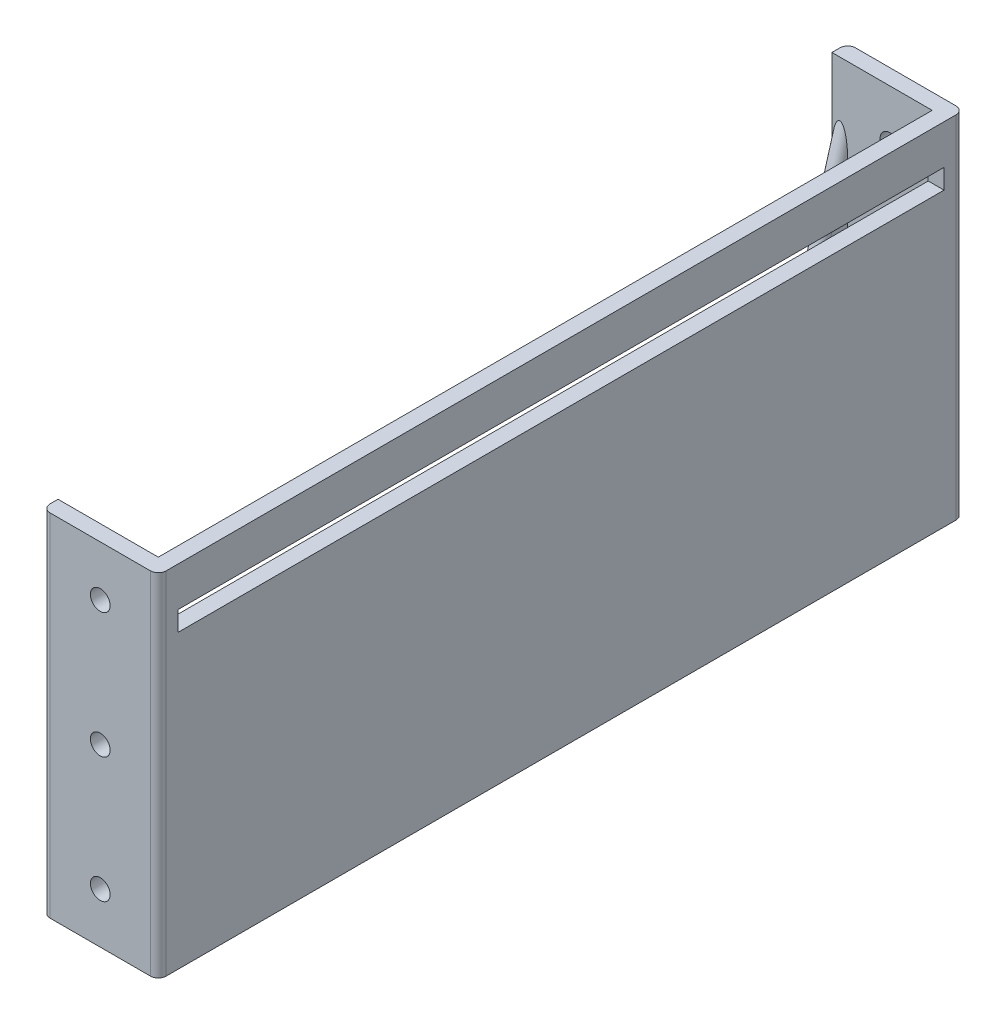
ISO-10303-21;
HEADER;
FILE_DESCRIPTION(('STEP AP214'),'2;1');
FILE_NAME('part.step','',(''),(''),'','','');
FILE_SCHEMA(('AUTOMOTIVE_DESIGN { 1 0 10303 214 1 1 1 1 }'));
ENDSEC;
DATA;
#1=APPLICATION_CONTEXT('core data for automotive mechanical design processes');
#2=APPLICATION_PROTOCOL_DEFINITION('international standard','automotive_design',2000,#1);
#3=PRODUCT_CONTEXT('',#1,'mechanical');
#4=PRODUCT('Part','Part','',(#3));
#5=PRODUCT_RELATED_PRODUCT_CATEGORY('part','',(#4));
#6=PRODUCT_DEFINITION_FORMATION('','',#4);
#7=PRODUCT_DEFINITION_CONTEXT('part definition',#1,'design');
#8=PRODUCT_DEFINITION('design','',#6,#7);
#9=PRODUCT_DEFINITION_SHAPE('','',#8);
#10=(LENGTH_UNIT() NAMED_UNIT(*) SI_UNIT(.MILLI.,.METRE.));
#11=(NAMED_UNIT(*) PLANE_ANGLE_UNIT() SI_UNIT($,.RADIAN.));
#12=(NAMED_UNIT(*) SI_UNIT($,.STERADIAN.) SOLID_ANGLE_UNIT());
#13=UNCERTAINTY_MEASURE_WITH_UNIT(LENGTH_MEASURE(1.E-05),#10,'distance_accuracy_value','');
#14=(GEOMETRIC_REPRESENTATION_CONTEXT(3) GLOBAL_UNCERTAINTY_ASSIGNED_CONTEXT((#13)) GLOBAL_UNIT_ASSIGNED_CONTEXT((#10,
#11,#12)) REPRESENTATION_CONTEXT('',''));
#15=CARTESIAN_POINT('',(0.,0.,0.));
#16=DIRECTION('',(0.,0.,1.));
#17=DIRECTION('',(1.,0.,0.));
#18=AXIS2_PLACEMENT_3D('',#15,#16,#17);
#19=CARTESIAN_POINT('',(2.,81.6198901107195,4.));
#20=DIRECTION('',(0.,-0.961523947640823,-0.274721127897378));
#21=DIRECTION('',(0.,0.274721127897378,-0.961523947640823));
#22=AXIS2_PLACEMENT_3D('',#19,#20,#21);
#23=CYLINDRICAL_SURFACE('',#22,2.);
#24=DIRECTION('',(0.,0.961523947640823,0.274721127897378));
#25=VECTOR('',#24,1.);
#26=CARTESIAN_POINT('',(0.,81.6198901107195,4.));
#27=LINE('',#26,#25);
#28=CARTESIAN_POINT('',(0.,67.6198901107195,0.));
#29=VERTEX_POINT('',#28);
#30=CARTESIAN_POINT('',(0.,4.,-18.1771114602056));
#31=VERTEX_POINT('',#30);
#32=EDGE_CURVE('E319',#29,#31,#27,.F.);
#33=ORIENTED_EDGE('',*,*,#32,.F.);
#34=CARTESIAN_POINT('',(2.,67.6198901107195,0.));
#35=DIRECTION('',(0.,0.,-1.));
#36=DIRECTION('',(0.,-1.,0.));
#37=AXIS2_PLACEMENT_3D('',#34,#35,#36);
#38=ELLIPSE('',#37,7.28010988928051,2.);
#39=CARTESIAN_POINT('',(4.,67.6198901107195,0.));
#40=VERTEX_POINT('',#39);
#41=EDGE_CURVE('E325',#40,#29,#38,.F.);
#42=ORIENTED_EDGE('',*,*,#41,.F.);
#43=DIRECTION('',(0.,-0.961523947640823,-0.274721127897378));
#44=VECTOR('',#43,1.);
#45=CARTESIAN_POINT('',(4.,5.10338793288449,-17.8618577650957));
#46=LINE('',#45,#44);
#47=CARTESIAN_POINT('',(4.,4.,-18.1771114602056));
#48=VERTEX_POINT('',#47);
#49=EDGE_CURVE('E322',#48,#40,#46,.F.);
#50=ORIENTED_EDGE('',*,*,#49,.F.);
#51=CARTESIAN_POINT('',(2.,4.,-18.1771114602056));
#52=DIRECTION('',(0.,-1.,0.));
#53=DIRECTION('',(0.,0.,-1.));
#54=AXIS2_PLACEMENT_3D('',#51,#52,#53);
#55=ELLIPSE('',#54,2.08003139693729,2.);
#56=EDGE_CURVE('E328',#31,#48,#55,.T.);
#57=ORIENTED_EDGE('',*,*,#56,.F.);
#58=EDGE_LOOP('',(#33,#42,#50,#57));
#59=FACE_BOUND('',#58,.T.);
#60=ADVANCED_FACE('F35',(#59),#23,.T.);
#61=CARTESIAN_POINT('',(2.,0.,-176.680031396937));
#62=DIRECTION('',(0.,0.961523947640823,-0.274721127897378));
#63=DIRECTION('',(0.,0.274721127897378,0.961523947640823));
#64=AXIS2_PLACEMENT_3D('',#61,#62,#63);
#65=CYLINDRICAL_SURFACE('',#64,2.00000000000001);
#66=DIRECTION('',(0.,-0.961523947640823,0.274721127897378));
#67=VECTOR('',#66,1.);
#68=CARTESIAN_POINT('',(0.,0.,-176.680031396937));
#69=LINE('',#68,#67);
#70=CARTESIAN_POINT('',(0.,4.,-177.822888539794));
#71=VERTEX_POINT('',#70);
#72=CARTESIAN_POINT('',(0.,67.6198901107195,-196.));
#73=VERTEX_POINT('',#72);
#74=EDGE_CURVE('E308',#71,#73,#69,.F.);
#75=ORIENTED_EDGE('',*,*,#74,.F.);
#76=CARTESIAN_POINT('',(2.,4.,-177.822888539794));
#77=DIRECTION('',(0.,-1.,0.));
#78=DIRECTION('',(0.,0.,-1.));
#79=AXIS2_PLACEMENT_3D('',#76,#77,#78);
#80=ELLIPSE('',#79,2.0800313969373,2.00000000000001);
#81=CARTESIAN_POINT('',(4.,4.,-177.822888539794));
#82=VERTEX_POINT('',#81);
#83=EDGE_CURVE('E314',#82,#71,#80,.T.);
#84=ORIENTED_EDGE('',*,*,#83,.F.);
#85=DIRECTION('',(0.,0.961523947640823,-0.274721127897378));
#86=VECTOR('',#85,1.);
#87=CARTESIAN_POINT('',(4.,-46.6701969727759,-163.345689404716));
#88=LINE('',#87,#86);
#89=CARTESIAN_POINT('',(4.,67.6198901107195,-196.));
#90=VERTEX_POINT('',#89);
#91=EDGE_CURVE('E311',#90,#82,#88,.F.);
#92=ORIENTED_EDGE('',*,*,#91,.F.);
#93=CARTESIAN_POINT('',(2.,67.6198901107195,-196.));
#94=DIRECTION('',(0.,0.,1.));
#95=DIRECTION('',(0.,1.,0.));
#96=AXIS2_PLACEMENT_3D('',#93,#94,#95);
#97=ELLIPSE('',#96,7.28010988928054,2.00000000000001);
#98=EDGE_CURVE('E317',#73,#90,#97,.F.);
#99=ORIENTED_EDGE('',*,*,#98,.F.);
#100=EDGE_LOOP('',(#75,#84,#92,#99));
#101=FACE_BOUND('',#100,.T.);
#102=ADVANCED_FACE('F431',(#101),#65,.T.);
#103=CARTESIAN_POINT('',(0.,0.,0.));
#104=DIRECTION('',(0.,0.,-1.));
#105=DIRECTION('',(-1.,0.,0.));
#106=AXIS2_PLACEMENT_3D('',#103,#104,#105);
#107=PLANE('',#106);
#108=CARTESIAN_POINT('',(14.7,12.75,0.));
#109=DIRECTION('',(0.,0.,-1.));
#110=DIRECTION('',(-1.,0.,0.));
#111=AXIS2_PLACEMENT_3D('',#108,#109,#110);
#112=CIRCLE('',#111,2.5);
#113=CARTESIAN_POINT('',(12.2,12.75,0.));
#114=VERTEX_POINT('',#113);
#115=EDGE_CURVE('E241',#114,#114,#112,.T.);
#116=ORIENTED_EDGE('',*,*,#115,.F.);
#117=EDGE_LOOP('',(#116));
#118=FACE_BOUND('',#117,.T.);
#119=CARTESIAN_POINT('',(14.7,76.15,0.));
#120=DIRECTION('',(0.,0.,-1.));
#121=DIRECTION('',(-1.,0.,0.));
#122=AXIS2_PLACEMENT_3D('',#119,#120,#121);
#123=CIRCLE('',#122,2.5);
#124=CARTESIAN_POINT('',(12.2,76.15,0.));
#125=VERTEX_POINT('',#124);
#126=EDGE_CURVE('E235',#125,#125,#123,.T.);
#127=ORIENTED_EDGE('',*,*,#126,.F.);
#128=EDGE_LOOP('',(#127));
#129=FACE_BOUND('',#128,.T.);
#130=CARTESIAN_POINT('',(14.7,44.45,0.));
#131=DIRECTION('',(0.,0.,-1.));
#132=DIRECTION('',(-1.,0.,0.));
#133=AXIS2_PLACEMENT_3D('',#130,#131,#132);
#134=CIRCLE('',#133,2.5);
#135=CARTESIAN_POINT('',(12.2,44.45,0.));
#136=VERTEX_POINT('',#135);
#137=EDGE_CURVE('E229',#136,#136,#134,.T.);
#138=ORIENTED_EDGE('',*,*,#137,.F.);
#139=EDGE_LOOP('',(#138));
#140=FACE_BOUND('',#139,.T.);
#141=ORIENTED_EDGE('',*,*,#41,.T.);
#142=DIRECTION('',(0.,-1.,0.));
#143=VECTOR('',#142,1.);
#144=CARTESIAN_POINT('',(0.,0.,0.));
#145=LINE('',#144,#143);
#146=CARTESIAN_POINT('',(0.,88.9,0.));
#147=VERTEX_POINT('',#146);
#148=EDGE_CURVE('E280',#147,#29,#145,.T.);
#149=ORIENTED_EDGE('',*,*,#148,.F.);
#150=DIRECTION('',(-1.,0.,0.));
#151=VECTOR('',#150,1.);
#152=CARTESIAN_POINT('',(0.,88.9,0.));
#153=LINE('',#152,#151);
#154=CARTESIAN_POINT('',(25.4,88.9,0.));
#155=VERTEX_POINT('',#154);
#156=EDGE_CURVE('E288',#155,#147,#153,.T.);
#157=ORIENTED_EDGE('',*,*,#156,.F.);
#158=DIRECTION('',(0.,1.,0.));
#159=VECTOR('',#158,1.);
#160=CARTESIAN_POINT('',(25.4,0.,0.));
#161=LINE('',#160,#159);
#162=CARTESIAN_POINT('',(25.4,4.,0.));
#163=VERTEX_POINT('',#162);
#164=EDGE_CURVE('E293',#163,#155,#161,.T.);
#165=ORIENTED_EDGE('',*,*,#164,.F.);
#166=DIRECTION('',(-1.,0.,0.));
#167=VECTOR('',#166,1.);
#168=CARTESIAN_POINT('',(0.,4.,0.));
#169=LINE('',#168,#167);
#170=CARTESIAN_POINT('',(4.,4.,0.));
#171=VERTEX_POINT('',#170);
#172=EDGE_CURVE('E255',#163,#171,#169,.T.);
#173=ORIENTED_EDGE('',*,*,#172,.T.);
#174=DIRECTION('',(0.,-1.,0.));
#175=VECTOR('',#174,1.);
#176=CARTESIAN_POINT('',(4.,0.,0.));
#177=LINE('',#176,#175);
#178=EDGE_CURVE('E244',#40,#171,#177,.T.);
#179=ORIENTED_EDGE('',*,*,#178,.F.);
#180=EDGE_LOOP('',(#141,#149,#157,#165,#173,#179));
#181=FACE_BOUND('',#180,.T.);
#182=ADVANCED_FACE('F399',(#118,#129,#140,#181),#107,.T.);
#183=CARTESIAN_POINT('',(25.4,0.,0.));
#184=DIRECTION('',(-1.,0.,0.));
#185=DIRECTION('',(0.,0.,1.));
#186=AXIS2_PLACEMENT_3D('',#183,#184,#185);
#187=PLANE('',#186);
#188=DIRECTION('',(0.,-1.,0.));
#189=VECTOR('',#188,1.);
#190=CARTESIAN_POINT('',(25.4,78.9,-1.));
#191=LINE('',#190,#189);
#192=CARTESIAN_POINT('',(25.4,78.9,-1.));
#193=VERTEX_POINT('',#192);
#194=CARTESIAN_POINT('',(25.4,73.9,-1.));
#195=VERTEX_POINT('',#194);
#196=EDGE_CURVE('E174',#193,#195,#191,.T.);
#197=ORIENTED_EDGE('',*,*,#196,.T.);
#198=DIRECTION('',(0.,0.,-1.));
#199=VECTOR('',#198,1.);
#200=CARTESIAN_POINT('',(25.4,73.9,-1.));
#201=LINE('',#200,#199);
#202=CARTESIAN_POINT('',(25.4,73.9,-195.));
#203=VERTEX_POINT('',#202);
#204=EDGE_CURVE('E183',#195,#203,#201,.T.);
#205=ORIENTED_EDGE('',*,*,#204,.T.);
#206=DIRECTION('',(0.,1.,0.));
#207=VECTOR('',#206,1.);
#208=CARTESIAN_POINT('',(25.4,78.9,-195.));
#209=LINE('',#208,#207);
#210=CARTESIAN_POINT('',(25.4,78.9,-195.));
#211=VERTEX_POINT('',#210);
#212=EDGE_CURVE('E50',#203,#211,#209,.T.);
#213=ORIENTED_EDGE('',*,*,#212,.T.);
#214=DIRECTION('',(0.,0.,1.));
#215=VECTOR('',#214,1.);
#216=CARTESIAN_POINT('',(25.4,78.9,-1.));
#217=LINE('',#216,#215);
#218=EDGE_CURVE('E180',#211,#193,#217,.T.);
#219=ORIENTED_EDGE('',*,*,#218,.T.);
#220=EDGE_LOOP('',(#197,#205,#213,#219));
#221=FACE_BOUND('',#220,.T.);
#222=DIRECTION('',(0.,1.,0.));
#223=VECTOR('',#222,1.);
#224=CARTESIAN_POINT('',(25.4,0.,-196.));
#225=LINE('',#224,#223);
#226=CARTESIAN_POINT('',(25.4,4.,-196.));
#227=VERTEX_POINT('',#226);
#228=CARTESIAN_POINT('',(25.4,88.9,-196.));
#229=VERTEX_POINT('',#228);
#230=EDGE_CURVE('E272',#227,#229,#225,.T.);
#231=ORIENTED_EDGE('',*,*,#230,.F.);
#232=DIRECTION('',(0.,0.,1.));
#233=VECTOR('',#232,1.);
#234=CARTESIAN_POINT('',(25.4,4.,0.));
#235=LINE('',#234,#233);
#236=EDGE_CURVE('E252',#227,#163,#235,.T.);
#237=ORIENTED_EDGE('',*,*,#236,.T.);
#238=ORIENTED_EDGE('',*,*,#164,.T.);
#239=DIRECTION('',(0.,0.,1.));
#240=VECTOR('',#239,1.);
#241=CARTESIAN_POINT('',(25.4,88.9,4.));
#242=LINE('',#241,#240);
#243=EDGE_CURVE('E277',#229,#155,#242,.T.);
#244=ORIENTED_EDGE('',*,*,#243,.F.);
#245=EDGE_LOOP('',(#231,#237,#238,#244));
#246=FACE_BOUND('',#245,.T.);
#247=ADVANCED_FACE('F187',(#221,#246),#187,.T.);
#248=CARTESIAN_POINT('',(0.,0.,-196.));
#249=DIRECTION('',(0.,0.,1.));
#250=DIRECTION('',(1.,0.,0.));
#251=AXIS2_PLACEMENT_3D('',#248,#249,#250);
#252=PLANE('',#251);
#253=CARTESIAN_POINT('',(14.7,12.75,-196.));
#254=DIRECTION('',(0.,0.,1.));
#255=DIRECTION('',(1.,0.,0.));
#256=AXIS2_PLACEMENT_3D('',#253,#254,#255);
#257=CIRCLE('',#256,2.5);
#258=CARTESIAN_POINT('',(17.2,12.75,-196.));
#259=VERTEX_POINT('',#258);
#260=EDGE_CURVE('E238',#259,#259,#257,.T.);
#261=ORIENTED_EDGE('',*,*,#260,.F.);
#262=EDGE_LOOP('',(#261));
#263=FACE_BOUND('',#262,.T.);
#264=CARTESIAN_POINT('',(14.7,76.15,-196.));
#265=DIRECTION('',(0.,0.,1.));
#266=DIRECTION('',(1.,0.,0.));
#267=AXIS2_PLACEMENT_3D('',#264,#265,#266);
#268=CIRCLE('',#267,2.5);
#269=CARTESIAN_POINT('',(17.2,76.15,-196.));
#270=VERTEX_POINT('',#269);
#271=EDGE_CURVE('E232',#270,#270,#268,.T.);
#272=ORIENTED_EDGE('',*,*,#271,.F.);
#273=EDGE_LOOP('',(#272));
#274=FACE_BOUND('',#273,.T.);
#275=CARTESIAN_POINT('',(14.7,44.45,-196.));
#276=DIRECTION('',(0.,0.,1.));
#277=DIRECTION('',(1.,0.,0.));
#278=AXIS2_PLACEMENT_3D('',#275,#276,#277);
#279=CIRCLE('',#278,2.5);
#280=CARTESIAN_POINT('',(17.2,44.45,-196.));
#281=VERTEX_POINT('',#280);
#282=EDGE_CURVE('E212',#281,#281,#279,.T.);
#283=ORIENTED_EDGE('',*,*,#282,.F.);
#284=EDGE_LOOP('',(#283));
#285=FACE_BOUND('',#284,.T.);
#286=DIRECTION('',(0.,1.,0.));
#287=VECTOR('',#286,1.);
#288=CARTESIAN_POINT('',(0.,0.,-196.));
#289=LINE('',#288,#287);
#290=CARTESIAN_POINT('',(0.,88.9,-196.));
#291=VERTEX_POINT('',#290);
#292=EDGE_CURVE('E258',#73,#291,#289,.T.);
#293=ORIENTED_EDGE('',*,*,#292,.F.);
#294=ORIENTED_EDGE('',*,*,#98,.T.);
#295=DIRECTION('',(0.,1.,0.));
#296=VECTOR('',#295,1.);
#297=CARTESIAN_POINT('',(4.,0.,-196.));
#298=LINE('',#297,#296);
#299=CARTESIAN_POINT('',(4.,4.,-196.));
#300=VERTEX_POINT('',#299);
#301=EDGE_CURVE('E247',#300,#90,#298,.T.);
#302=ORIENTED_EDGE('',*,*,#301,.F.);
#303=DIRECTION('',(1.,0.,0.));
#304=VECTOR('',#303,1.);
#305=CARTESIAN_POINT('',(0.,4.,-196.));
#306=LINE('',#305,#304);
#307=EDGE_CURVE('E301',#300,#227,#306,.T.);
#308=ORIENTED_EDGE('',*,*,#307,.T.);
#309=ORIENTED_EDGE('',*,*,#230,.T.);
#310=DIRECTION('',(1.,0.,0.));
#311=VECTOR('',#310,1.);
#312=CARTESIAN_POINT('',(29.4,88.9,-196.));
#313=LINE('',#312,#311);
#314=EDGE_CURVE('E263',#291,#229,#313,.T.);
#315=ORIENTED_EDGE('',*,*,#314,.F.);
#316=EDGE_LOOP('',(#293,#294,#302,#308,#309,#315));
#317=FACE_BOUND('',#316,.T.);
#318=ADVANCED_FACE('F389',(#263,#274,#285,#317),#252,.T.);
#319=CARTESIAN_POINT('',(0.,0.,4.));
#320=DIRECTION('',(1.,0.,0.));
#321=DIRECTION('',(0.,0.,-1.));
#322=AXIS2_PLACEMENT_3D('',#319,#320,#321);
#323=PLANE('',#322);
#324=DIRECTION('',(0.,0.,-1.));
#325=VECTOR('',#324,1.);
#326=CARTESIAN_POINT('',(0.,0.,4.));
#327=LINE('',#326,#325);
#328=CARTESIAN_POINT('',(0.,0.,2.));
#329=VERTEX_POINT('',#328);
#330=CARTESIAN_POINT('',(0.,0.,-198.));
#331=VERTEX_POINT('',#330);
#332=EDGE_CURVE('E298',#329,#331,#327,.T.);
#333=ORIENTED_EDGE('',*,*,#332,.F.);
#334=DIRECTION('',(0.,-1.,0.));
#335=VECTOR('',#334,1.);
#336=CARTESIAN_POINT('',(0.,0.,2.));
#337=LINE('',#336,#335);
#338=CARTESIAN_POINT('',(0.,88.9,2.));
#339=VERTEX_POINT('',#338);
#340=EDGE_CURVE('E345',#329,#339,#337,.F.);
#341=ORIENTED_EDGE('',*,*,#340,.T.);
#342=DIRECTION('',(0.,0.,-1.));
#343=VECTOR('',#342,1.);
#344=CARTESIAN_POINT('',(0.,88.9,4.));
#345=LINE('',#344,#343);
#346=EDGE_CURVE('E291',#339,#147,#345,.T.);
#347=ORIENTED_EDGE('',*,*,#346,.T.);
#348=ORIENTED_EDGE('',*,*,#148,.T.);
#349=ORIENTED_EDGE('',*,*,#32,.T.);
#350=DIRECTION('',(0.,0.,-1.));
#351=VECTOR('',#350,1.);
#352=CARTESIAN_POINT('',(0.,4.,-200.));
#353=LINE('',#352,#351);
#354=EDGE_CURVE('E250',#31,#71,#353,.T.);
#355=ORIENTED_EDGE('',*,*,#354,.T.);
#356=ORIENTED_EDGE('',*,*,#74,.T.);
#357=ORIENTED_EDGE('',*,*,#292,.T.);
#358=DIRECTION('',(0.,0.,1.));
#359=VECTOR('',#358,1.);
#360=CARTESIAN_POINT('',(0.,88.9,-200.));
#361=LINE('',#360,#359);
#362=CARTESIAN_POINT('',(0.,88.9,-198.));
#363=VERTEX_POINT('',#362);
#364=EDGE_CURVE('E266',#363,#291,#361,.T.);
#365=ORIENTED_EDGE('',*,*,#364,.F.);
#366=DIRECTION('',(0.,1.,0.));
#367=VECTOR('',#366,1.);
#368=CARTESIAN_POINT('',(0.,0.,-198.));
#369=LINE('',#368,#367);
#370=EDGE_CURVE('E343',#363,#331,#369,.F.);
#371=ORIENTED_EDGE('',*,*,#370,.T.);
#372=EDGE_LOOP('',(#333,#341,#347,#348,#349,#355,#356,#357,#365,#371));
#373=FACE_BOUND('',#372,.T.);
#374=ADVANCED_FACE('F384',(#373),#323,.F.);
#375=CARTESIAN_POINT('',(0.,0.,4.));
#376=DIRECTION('',(0.,1.,0.));
#377=DIRECTION('',(0.,0.,1.));
#378=AXIS2_PLACEMENT_3D('',#375,#376,#377);
#379=PLANE('',#378);
#380=DIRECTION('',(1.,0.,0.));
#381=VECTOR('',#380,1.);
#382=CARTESIAN_POINT('',(0.,0.,4.));
#383=LINE('',#382,#381);
#384=CARTESIAN_POINT('',(2.,0.,4.));
#385=VERTEX_POINT('',#384);
#386=CARTESIAN_POINT('',(27.4,0.,4.));
#387=VERTEX_POINT('',#386);
#388=EDGE_CURVE('E284',#385,#387,#383,.T.);
#389=ORIENTED_EDGE('',*,*,#388,.F.);
#390=CARTESIAN_POINT('',(2.,0.,2.));
#391=DIRECTION('',(0.,1.,0.));
#392=DIRECTION('',(0.,0.,1.));
#393=AXIS2_PLACEMENT_3D('',#390,#391,#392);
#394=CIRCLE('',#393,2.);
#395=EDGE_CURVE('E341',#385,#329,#394,.F.);
#396=ORIENTED_EDGE('',*,*,#395,.T.);
#397=ORIENTED_EDGE('',*,*,#332,.T.);
#398=CARTESIAN_POINT('',(2.,0.,-198.));
#399=DIRECTION('',(0.,1.,0.));
#400=DIRECTION('',(0.,0.,1.));
#401=AXIS2_PLACEMENT_3D('',#398,#399,#400);
#402=CIRCLE('',#401,2.);
#403=CARTESIAN_POINT('',(2.,0.,-200.));
#404=VERTEX_POINT('',#403);
#405=EDGE_CURVE('E335',#331,#404,#402,.F.);
#406=ORIENTED_EDGE('',*,*,#405,.T.);
#407=DIRECTION('',(-1.,0.,0.));
#408=VECTOR('',#407,1.);
#409=CARTESIAN_POINT('',(29.4,0.,-200.));
#410=LINE('',#409,#408);
#411=CARTESIAN_POINT('',(27.4,0.,-200.));
#412=VERTEX_POINT('',#411);
#413=EDGE_CURVE('E259',#412,#404,#410,.T.);
#414=ORIENTED_EDGE('',*,*,#413,.F.);
#415=CARTESIAN_POINT('',(27.4,0.,-198.));
#416=DIRECTION('',(0.,1.,0.));
#417=DIRECTION('',(0.,0.,1.));
#418=AXIS2_PLACEMENT_3D('',#415,#416,#417);
#419=CIRCLE('',#418,2.);
#420=CARTESIAN_POINT('',(29.4,0.,-198.));
#421=VERTEX_POINT('',#420);
#422=EDGE_CURVE('E337',#412,#421,#419,.F.);
#423=ORIENTED_EDGE('',*,*,#422,.T.);
#424=DIRECTION('',(0.,0.,-1.));
#425=VECTOR('',#424,1.);
#426=CARTESIAN_POINT('',(29.4,0.,4.));
#427=LINE('',#426,#425);
#428=CARTESIAN_POINT('',(29.4,0.,2.));
#429=VERTEX_POINT('',#428);
#430=EDGE_CURVE('E273',#429,#421,#427,.T.);
#431=ORIENTED_EDGE('',*,*,#430,.F.);
#432=CARTESIAN_POINT('',(27.4,0.,2.));
#433=DIRECTION('',(0.,1.,0.));
#434=DIRECTION('',(0.,0.,1.));
#435=AXIS2_PLACEMENT_3D('',#432,#433,#434);
#436=CIRCLE('',#435,2.);
#437=EDGE_CURVE('E339',#429,#387,#436,.F.);
#438=ORIENTED_EDGE('',*,*,#437,.T.);
#439=EDGE_LOOP('',(#389,#396,#397,#406,#414,#423,#431,#438));
#440=FACE_BOUND('',#439,.T.);
#441=ADVANCED_FACE('F379',(#440),#379,.F.);
#442=CARTESIAN_POINT('',(0.,88.9,4.));
#443=DIRECTION('',(0.,-1.,0.));
#444=DIRECTION('',(0.,0.,-1.));
#445=AXIS2_PLACEMENT_3D('',#442,#443,#444);
#446=PLANE('',#445);
#447=ORIENTED_EDGE('',*,*,#346,.F.);
#448=CARTESIAN_POINT('',(2.,88.9,2.));
#449=DIRECTION('',(0.,-1.,0.));
#450=DIRECTION('',(0.,0.,-1.));
#451=AXIS2_PLACEMENT_3D('',#448,#449,#450);
#452=CIRCLE('',#451,2.);
#453=CARTESIAN_POINT('',(2.,88.9,4.));
#454=VERTEX_POINT('',#453);
#455=EDGE_CURVE('E353',#339,#454,#452,.F.);
#456=ORIENTED_EDGE('',*,*,#455,.T.);
#457=DIRECTION('',(-1.,0.,0.));
#458=VECTOR('',#457,1.);
#459=CARTESIAN_POINT('',(0.,88.9,4.));
#460=LINE('',#459,#458);
#461=CARTESIAN_POINT('',(27.4,88.9,4.));
#462=VERTEX_POINT('',#461);
#463=EDGE_CURVE('E287',#462,#454,#460,.T.);
#464=ORIENTED_EDGE('',*,*,#463,.F.);
#465=CARTESIAN_POINT('',(27.4,88.9,2.));
#466=DIRECTION('',(0.,-1.,0.));
#467=DIRECTION('',(0.,0.,-1.));
#468=AXIS2_PLACEMENT_3D('',#465,#466,#467);
#469=CIRCLE('',#468,2.);
#470=CARTESIAN_POINT('',(29.4,88.9,2.));
#471=VERTEX_POINT('',#470);
#472=EDGE_CURVE('E351',#462,#471,#469,.F.);
#473=ORIENTED_EDGE('',*,*,#472,.T.);
#474=DIRECTION('',(0.,0.,1.));
#475=VECTOR('',#474,1.);
#476=CARTESIAN_POINT('',(29.4,88.9,4.));
#477=LINE('',#476,#475);
#478=CARTESIAN_POINT('',(29.4,88.9,-198.));
#479=VERTEX_POINT('',#478);
#480=EDGE_CURVE('E276',#479,#471,#477,.T.);
#481=ORIENTED_EDGE('',*,*,#480,.F.);
#482=CARTESIAN_POINT('',(27.4,88.9,-198.));
#483=DIRECTION('',(0.,-1.,0.));
#484=DIRECTION('',(0.,0.,-1.));
#485=AXIS2_PLACEMENT_3D('',#482,#483,#484);
#486=CIRCLE('',#485,2.);
#487=CARTESIAN_POINT('',(27.4,88.9,-200.));
#488=VERTEX_POINT('',#487);
#489=EDGE_CURVE('E349',#479,#488,#486,.F.);
#490=ORIENTED_EDGE('',*,*,#489,.T.);
#491=DIRECTION('',(1.,0.,0.));
#492=VECTOR('',#491,1.);
#493=CARTESIAN_POINT('',(29.4,88.9,-200.));
#494=LINE('',#493,#492);
#495=CARTESIAN_POINT('',(2.,88.9,-200.));
#496=VERTEX_POINT('',#495);
#497=EDGE_CURVE('E262',#496,#488,#494,.T.);
#498=ORIENTED_EDGE('',*,*,#497,.F.);
#499=CARTESIAN_POINT('',(2.,88.9,-198.));
#500=DIRECTION('',(0.,-1.,0.));
#501=DIRECTION('',(0.,0.,-1.));
#502=AXIS2_PLACEMENT_3D('',#499,#500,#501);
#503=CIRCLE('',#502,2.);
#504=EDGE_CURVE('E347',#496,#363,#503,.F.);
#505=ORIENTED_EDGE('',*,*,#504,.T.);
#506=ORIENTED_EDGE('',*,*,#364,.T.);
#507=ORIENTED_EDGE('',*,*,#314,.T.);
#508=ORIENTED_EDGE('',*,*,#243,.T.);
#509=ORIENTED_EDGE('',*,*,#156,.T.);
#510=EDGE_LOOP('',(#447,#456,#464,#473,#481,#490,#498,#505,#506,#507,#508,#509));
#511=FACE_BOUND('',#510,.T.);
#512=ADVANCED_FACE('F370',(#511),#446,.F.);
#513=CARTESIAN_POINT('',(0.,0.,4.));
#514=DIRECTION('',(0.,0.,-1.));
#515=DIRECTION('',(-1.,0.,0.));
#516=AXIS2_PLACEMENT_3D('',#513,#514,#515);
#517=PLANE('',#516);
#518=CARTESIAN_POINT('',(14.7,12.75,4.));
#519=DIRECTION('',(0.,0.,-1.));
#520=DIRECTION('',(-1.,0.,0.));
#521=AXIS2_PLACEMENT_3D('',#518,#519,#520);
#522=CIRCLE('',#521,2.5);
#523=CARTESIAN_POINT('',(12.2,12.75,4.));
#524=VERTEX_POINT('',#523);
#525=EDGE_CURVE('E209',#524,#524,#522,.T.);
#526=ORIENTED_EDGE('',*,*,#525,.T.);
#527=EDGE_LOOP('',(#526));
#528=FACE_BOUND('',#527,.T.);
#529=CARTESIAN_POINT('',(14.7,76.15,4.));
#530=DIRECTION('',(0.,0.,-1.));
#531=DIRECTION('',(-1.,0.,0.));
#532=AXIS2_PLACEMENT_3D('',#529,#530,#531);
#533=CIRCLE('',#532,2.5);
#534=CARTESIAN_POINT('',(12.2,76.15,4.));
#535=VERTEX_POINT('',#534);
#536=EDGE_CURVE('E216',#535,#535,#533,.T.);
#537=ORIENTED_EDGE('',*,*,#536,.T.);
#538=EDGE_LOOP('',(#537));
#539=FACE_BOUND('',#538,.T.);
#540=CARTESIAN_POINT('',(14.7,44.45,4.));
#541=DIRECTION('',(0.,0.,-1.));
#542=DIRECTION('',(-1.,0.,0.));
#543=AXIS2_PLACEMENT_3D('',#540,#541,#542);
#544=CIRCLE('',#543,2.5);
#545=CARTESIAN_POINT('',(12.2,44.45,4.));
#546=VERTEX_POINT('',#545);
#547=EDGE_CURVE('E222',#546,#546,#544,.T.);
#548=ORIENTED_EDGE('',*,*,#547,.T.);
#549=EDGE_LOOP('',(#548));
#550=FACE_BOUND('',#549,.T.);
#551=ORIENTED_EDGE('',*,*,#463,.T.);
#552=DIRECTION('',(0.,-1.,0.));
#553=VECTOR('',#552,1.);
#554=CARTESIAN_POINT('',(2.,0.,4.));
#555=LINE('',#554,#553);
#556=EDGE_CURVE('E332',#454,#385,#555,.T.);
#557=ORIENTED_EDGE('',*,*,#556,.T.);
#558=ORIENTED_EDGE('',*,*,#388,.T.);
#559=DIRECTION('',(0.,-1.,0.));
#560=VECTOR('',#559,1.);
#561=CARTESIAN_POINT('',(27.4,0.,4.));
#562=LINE('',#561,#560);
#563=EDGE_CURVE('E330',#387,#462,#562,.F.);
#564=ORIENTED_EDGE('',*,*,#563,.T.);
#565=EDGE_LOOP('',(#551,#557,#558,#564));
#566=FACE_BOUND('',#565,.T.);
#567=ADVANCED_FACE('F406',(#528,#539,#550,#566),#517,.F.);
#568=CARTESIAN_POINT('',(29.4,0.,0.));
#569=DIRECTION('',(-1.,0.,0.));
#570=DIRECTION('',(0.,0.,1.));
#571=AXIS2_PLACEMENT_3D('',#568,#569,#570);
#572=PLANE('',#571);
#573=DIRECTION('',(0.,0.,-1.));
#574=VECTOR('',#573,1.);
#575=CARTESIAN_POINT('',(29.4,73.9,-1.));
#576=LINE('',#575,#574);
#577=CARTESIAN_POINT('',(29.4,73.9,-1.));
#578=VERTEX_POINT('',#577);
#579=CARTESIAN_POINT('',(29.4,73.9,-195.));
#580=VERTEX_POINT('',#579);
#581=EDGE_CURVE('E199',#578,#580,#576,.T.);
#582=ORIENTED_EDGE('',*,*,#581,.F.);
#583=DIRECTION('',(0.,-1.,0.));
#584=VECTOR('',#583,1.);
#585=CARTESIAN_POINT('',(29.4,78.9,-1.));
#586=LINE('',#585,#584);
#587=CARTESIAN_POINT('',(29.4,78.9,-1.));
#588=VERTEX_POINT('',#587);
#589=EDGE_CURVE('E58',#588,#578,#586,.T.);
#590=ORIENTED_EDGE('',*,*,#589,.F.);
#591=DIRECTION('',(0.,0.,1.));
#592=VECTOR('',#591,1.);
#593=CARTESIAN_POINT('',(29.4,78.9,-1.));
#594=LINE('',#593,#592);
#595=CARTESIAN_POINT('',(29.4,78.9,-195.));
#596=VERTEX_POINT('',#595);
#597=EDGE_CURVE('E190',#596,#588,#594,.T.);
#598=ORIENTED_EDGE('',*,*,#597,.F.);
#599=DIRECTION('',(0.,1.,0.));
#600=VECTOR('',#599,1.);
#601=CARTESIAN_POINT('',(29.4,78.9,-195.));
#602=LINE('',#601,#600);
#603=EDGE_CURVE('E193',#580,#596,#602,.T.);
#604=ORIENTED_EDGE('',*,*,#603,.F.);
#605=EDGE_LOOP('',(#582,#590,#598,#604));
#606=FACE_BOUND('',#605,.T.);
#607=ORIENTED_EDGE('',*,*,#480,.T.);
#608=DIRECTION('',(0.,-1.,0.));
#609=VECTOR('',#608,1.);
#610=CARTESIAN_POINT('',(29.4,0.,2.));
#611=LINE('',#610,#609);
#612=EDGE_CURVE('E357',#471,#429,#611,.T.);
#613=ORIENTED_EDGE('',*,*,#612,.T.);
#614=ORIENTED_EDGE('',*,*,#430,.T.);
#615=DIRECTION('',(0.,-1.,0.));
#616=VECTOR('',#615,1.);
#617=CARTESIAN_POINT('',(29.4,0.,-198.));
#618=LINE('',#617,#616);
#619=EDGE_CURVE('E355',#421,#479,#618,.F.);
#620=ORIENTED_EDGE('',*,*,#619,.T.);
#621=EDGE_LOOP('',(#607,#613,#614,#620));
#622=FACE_BOUND('',#621,.T.);
#623=ADVANCED_FACE('F413',(#606,#622),#572,.F.);
#624=CARTESIAN_POINT('',(0.,0.,-200.));
#625=DIRECTION('',(0.,0.,1.));
#626=DIRECTION('',(1.,0.,0.));
#627=AXIS2_PLACEMENT_3D('',#624,#625,#626);
#628=PLANE('',#627);
#629=CARTESIAN_POINT('',(14.7,12.75,-200.));
#630=DIRECTION('',(0.,0.,-1.));
#631=DIRECTION('',(-1.,0.,0.));
#632=AXIS2_PLACEMENT_3D('',#629,#630,#631);
#633=CIRCLE('',#632,2.5);
#634=CARTESIAN_POINT('',(12.2,12.75,-200.));
#635=VERTEX_POINT('',#634);
#636=EDGE_CURVE('E213',#635,#635,#633,.T.);
#637=ORIENTED_EDGE('',*,*,#636,.F.);
#638=EDGE_LOOP('',(#637));
#639=FACE_BOUND('',#638,.T.);
#640=CARTESIAN_POINT('',(14.7,76.15,-200.));
#641=DIRECTION('',(0.,0.,-1.));
#642=DIRECTION('',(-1.,0.,0.));
#643=AXIS2_PLACEMENT_3D('',#640,#641,#642);
#644=CIRCLE('',#643,2.5);
#645=CARTESIAN_POINT('',(12.2,76.15,-200.));
#646=VERTEX_POINT('',#645);
#647=EDGE_CURVE('E219',#646,#646,#644,.T.);
#648=ORIENTED_EDGE('',*,*,#647,.F.);
#649=EDGE_LOOP('',(#648));
#650=FACE_BOUND('',#649,.T.);
#651=CARTESIAN_POINT('',(14.7,44.45,-200.));
#652=DIRECTION('',(0.,0.,-1.));
#653=DIRECTION('',(-1.,0.,0.));
#654=AXIS2_PLACEMENT_3D('',#651,#652,#653);
#655=CIRCLE('',#654,2.5);
#656=CARTESIAN_POINT('',(12.2,44.45,-200.));
#657=VERTEX_POINT('',#656);
#658=EDGE_CURVE('E205',#657,#657,#655,.T.);
#659=ORIENTED_EDGE('',*,*,#658,.F.);
#660=EDGE_LOOP('',(#659));
#661=FACE_BOUND('',#660,.T.);
#662=ORIENTED_EDGE('',*,*,#497,.T.);
#663=DIRECTION('',(0.,-1.,0.));
#664=VECTOR('',#663,1.);
#665=CARTESIAN_POINT('',(27.4,0.,-200.));
#666=LINE('',#665,#664);
#667=EDGE_CURVE('E11',#488,#412,#666,.T.);
#668=ORIENTED_EDGE('',*,*,#667,.T.);
#669=ORIENTED_EDGE('',*,*,#413,.T.);
#670=DIRECTION('',(0.,1.,0.));
#671=VECTOR('',#670,1.);
#672=CARTESIAN_POINT('',(2.,0.,-200.));
#673=LINE('',#672,#671);
#674=EDGE_CURVE('E43',#404,#496,#673,.T.);
#675=ORIENTED_EDGE('',*,*,#674,.T.);
#676=EDGE_LOOP('',(#662,#668,#669,#675));
#677=FACE_BOUND('',#676,.T.);
#678=ADVANCED_FACE('F363',(#639,#650,#661,#677),#628,.F.);
#679=CARTESIAN_POINT('',(0.,4.,0.));
#680=DIRECTION('',(0.,-1.,0.));
#681=DIRECTION('',(0.,0.,-1.));
#682=AXIS2_PLACEMENT_3D('',#679,#680,#681);
#683=PLANE('',#682);
#684=ORIENTED_EDGE('',*,*,#56,.T.);
#685=DIRECTION('',(0.,0.,1.));
#686=VECTOR('',#685,1.);
#687=CARTESIAN_POINT('',(4.,4.,0.));
#688=LINE('',#687,#686);
#689=EDGE_CURVE('E306',#48,#171,#688,.T.);
#690=ORIENTED_EDGE('',*,*,#689,.T.);
#691=ORIENTED_EDGE('',*,*,#172,.F.);
#692=ORIENTED_EDGE('',*,*,#236,.F.);
#693=ORIENTED_EDGE('',*,*,#307,.F.);
#694=DIRECTION('',(0.,0.,1.));
#695=VECTOR('',#694,1.);
#696=CARTESIAN_POINT('',(4.,4.,0.));
#697=LINE('',#696,#695);
#698=EDGE_CURVE('E303',#300,#82,#697,.T.);
#699=ORIENTED_EDGE('',*,*,#698,.T.);
#700=ORIENTED_EDGE('',*,*,#83,.T.);
#701=ORIENTED_EDGE('',*,*,#354,.F.);
#702=EDGE_LOOP('',(#684,#690,#691,#692,#693,#699,#700,#701));
#703=FACE_BOUND('',#702,.T.);
#704=ADVANCED_FACE('F422',(#703),#683,.F.);
#705=CARTESIAN_POINT('',(4.,0.,0.));
#706=DIRECTION('',(1.,0.,0.));
#707=DIRECTION('',(0.,0.,-1.));
#708=AXIS2_PLACEMENT_3D('',#705,#706,#707);
#709=PLANE('',#708);
#710=ORIENTED_EDGE('',*,*,#301,.T.);
#711=ORIENTED_EDGE('',*,*,#91,.T.);
#712=ORIENTED_EDGE('',*,*,#698,.F.);
#713=EDGE_LOOP('',(#710,#711,#712));
#714=FACE_BOUND('',#713,.T.);
#715=ADVANCED_FACE('F485',(#714),#709,.T.);
#716=CARTESIAN_POINT('',(4.,0.,0.));
#717=DIRECTION('',(1.,0.,0.));
#718=DIRECTION('',(0.,0.,-1.));
#719=AXIS2_PLACEMENT_3D('',#716,#717,#718);
#720=PLANE('',#719);
#721=ORIENTED_EDGE('',*,*,#689,.F.);
#722=ORIENTED_EDGE('',*,*,#49,.T.);
#723=ORIENTED_EDGE('',*,*,#178,.T.);
#724=EDGE_LOOP('',(#721,#722,#723));
#725=FACE_BOUND('',#724,.T.);
#726=ADVANCED_FACE('F481',(#725),#720,.T.);
#727=CARTESIAN_POINT('',(14.7,44.45,4.));
#728=DIRECTION('',(0.,0.,-1.));
#729=DIRECTION('',(-1.,0.,0.));
#730=AXIS2_PLACEMENT_3D('',#727,#728,#729);
#731=CYLINDRICAL_SURFACE('',#730,2.5);
#732=ORIENTED_EDGE('',*,*,#282,.T.);
#733=EDGE_LOOP('',(#732));
#734=FACE_BOUND('',#733,.T.);
#735=ORIENTED_EDGE('',*,*,#658,.T.);
#736=EDGE_LOOP('',(#735));
#737=FACE_BOUND('',#736,.T.);
#738=ADVANCED_FACE('F476',(#734,#737),#731,.F.);
#739=CARTESIAN_POINT('',(14.7,76.15,4.));
#740=DIRECTION('',(0.,0.,-1.));
#741=DIRECTION('',(-1.,0.,0.));
#742=AXIS2_PLACEMENT_3D('',#739,#740,#741);
#743=CYLINDRICAL_SURFACE('',#742,2.5);
#744=ORIENTED_EDGE('',*,*,#271,.T.);
#745=EDGE_LOOP('',(#744));
#746=FACE_BOUND('',#745,.T.);
#747=ORIENTED_EDGE('',*,*,#647,.T.);
#748=EDGE_LOOP('',(#747));
#749=FACE_BOUND('',#748,.T.);
#750=ADVANCED_FACE('F472',(#746,#749),#743,.F.);
#751=CARTESIAN_POINT('',(14.7,12.75,4.));
#752=DIRECTION('',(0.,0.,-1.));
#753=DIRECTION('',(-1.,0.,0.));
#754=AXIS2_PLACEMENT_3D('',#751,#752,#753);
#755=CYLINDRICAL_SURFACE('',#754,2.5);
#756=ORIENTED_EDGE('',*,*,#260,.T.);
#757=EDGE_LOOP('',(#756));
#758=FACE_BOUND('',#757,.T.);
#759=ORIENTED_EDGE('',*,*,#636,.T.);
#760=EDGE_LOOP('',(#759));
#761=FACE_BOUND('',#760,.T.);
#762=ADVANCED_FACE('F468',(#758,#761),#755,.F.);
#763=ORIENTED_EDGE('',*,*,#137,.T.);
#764=EDGE_LOOP('',(#763));
#765=FACE_BOUND('',#764,.T.);
#766=ORIENTED_EDGE('',*,*,#547,.F.);
#767=EDGE_LOOP('',(#766));
#768=FACE_BOUND('',#767,.T.);
#769=ADVANCED_FACE('F471',(#765,#768),#731,.F.);
#770=ORIENTED_EDGE('',*,*,#126,.T.);
#771=EDGE_LOOP('',(#770));
#772=FACE_BOUND('',#771,.T.);
#773=ORIENTED_EDGE('',*,*,#536,.F.);
#774=EDGE_LOOP('',(#773));
#775=FACE_BOUND('',#774,.T.);
#776=ADVANCED_FACE('F478',(#772,#775),#743,.F.);
#777=ORIENTED_EDGE('',*,*,#115,.T.);
#778=EDGE_LOOP('',(#777));
#779=FACE_BOUND('',#778,.T.);
#780=ORIENTED_EDGE('',*,*,#525,.F.);
#781=EDGE_LOOP('',(#780));
#782=FACE_BOUND('',#781,.T.);
#783=ADVANCED_FACE('F449',(#779,#782),#755,.F.);
#784=CARTESIAN_POINT('',(2.,0.,2.));
#785=DIRECTION('',(0.,-1.,0.));
#786=DIRECTION('',(0.,0.,-1.));
#787=AXIS2_PLACEMENT_3D('',#784,#785,#786);
#788=CYLINDRICAL_SURFACE('',#787,2.);
#789=ORIENTED_EDGE('',*,*,#455,.F.);
#790=ORIENTED_EDGE('',*,*,#340,.F.);
#791=ORIENTED_EDGE('',*,*,#395,.F.);
#792=ORIENTED_EDGE('',*,*,#556,.F.);
#793=EDGE_LOOP('',(#789,#790,#791,#792));
#794=FACE_BOUND('',#793,.T.);
#795=ADVANCED_FACE('F404',(#794),#788,.T.);
#796=CARTESIAN_POINT('',(27.4,0.,2.));
#797=DIRECTION('',(0.,-1.,0.));
#798=DIRECTION('',(0.,0.,-1.));
#799=AXIS2_PLACEMENT_3D('',#796,#797,#798);
#800=CYLINDRICAL_SURFACE('',#799,2.);
#801=ORIENTED_EDGE('',*,*,#472,.F.);
#802=ORIENTED_EDGE('',*,*,#563,.F.);
#803=ORIENTED_EDGE('',*,*,#437,.F.);
#804=ORIENTED_EDGE('',*,*,#612,.F.);
#805=EDGE_LOOP('',(#801,#802,#803,#804));
#806=FACE_BOUND('',#805,.T.);
#807=ADVANCED_FACE('F411',(#806),#800,.T.);
#808=CARTESIAN_POINT('',(27.4,0.,-198.));
#809=DIRECTION('',(0.,-1.,0.));
#810=DIRECTION('',(0.,0.,-1.));
#811=AXIS2_PLACEMENT_3D('',#808,#809,#810);
#812=CYLINDRICAL_SURFACE('',#811,2.);
#813=ORIENTED_EDGE('',*,*,#489,.F.);
#814=ORIENTED_EDGE('',*,*,#619,.F.);
#815=ORIENTED_EDGE('',*,*,#422,.F.);
#816=ORIENTED_EDGE('',*,*,#667,.F.);
#817=EDGE_LOOP('',(#813,#814,#815,#816));
#818=FACE_BOUND('',#817,.T.);
#819=ADVANCED_FACE('F376',(#818),#812,.T.);
#820=CARTESIAN_POINT('',(2.,0.,-198.));
#821=DIRECTION('',(0.,1.,0.));
#822=DIRECTION('',(0.,0.,1.));
#823=AXIS2_PLACEMENT_3D('',#820,#821,#822);
#824=CYLINDRICAL_SURFACE('',#823,2.);
#825=ORIENTED_EDGE('',*,*,#405,.F.);
#826=ORIENTED_EDGE('',*,*,#370,.F.);
#827=ORIENTED_EDGE('',*,*,#504,.F.);
#828=ORIENTED_EDGE('',*,*,#674,.F.);
#829=EDGE_LOOP('',(#825,#826,#827,#828));
#830=FACE_BOUND('',#829,.T.);
#831=ADVANCED_FACE('F37',(#830),#824,.T.);
#832=CARTESIAN_POINT('',(25.4,78.9,-1.));
#833=DIRECTION('',(0.,0.,1.));
#834=DIRECTION('',(0.,-1.,0.));
#835=AXIS2_PLACEMENT_3D('',#832,#833,#834);
#836=PLANE('',#835);
#837=ORIENTED_EDGE('',*,*,#589,.T.);
#838=DIRECTION('',(1.,0.,0.));
#839=VECTOR('',#838,1.);
#840=CARTESIAN_POINT('',(25.4,73.9,-1.));
#841=LINE('',#840,#839);
#842=EDGE_CURVE('E170',#195,#578,#841,.T.);
#843=ORIENTED_EDGE('',*,*,#842,.F.);
#844=ORIENTED_EDGE('',*,*,#196,.F.);
#845=DIRECTION('',(1.,0.,0.));
#846=VECTOR('',#845,1.);
#847=CARTESIAN_POINT('',(25.4,78.9,-1.));
#848=LINE('',#847,#846);
#849=EDGE_CURVE('E203',#193,#588,#848,.T.);
#850=ORIENTED_EDGE('',*,*,#849,.T.);
#851=EDGE_LOOP('',(#837,#843,#844,#850));
#852=FACE_BOUND('',#851,.T.);
#853=ADVANCED_FACE('F172',(#852),#836,.F.);
#854=CARTESIAN_POINT('',(25.4,78.9,-1.));
#855=DIRECTION('',(0.,1.,0.));
#856=DIRECTION('',(0.,0.,1.));
#857=AXIS2_PLACEMENT_3D('',#854,#855,#856);
#858=PLANE('',#857);
#859=ORIENTED_EDGE('',*,*,#597,.T.);
#860=ORIENTED_EDGE('',*,*,#849,.F.);
#861=ORIENTED_EDGE('',*,*,#218,.F.);
#862=DIRECTION('',(1.,0.,0.));
#863=VECTOR('',#862,1.);
#864=CARTESIAN_POINT('',(25.4,78.9,-195.));
#865=LINE('',#864,#863);
#866=EDGE_CURVE('E206',#211,#596,#865,.T.);
#867=ORIENTED_EDGE('',*,*,#866,.T.);
#868=EDGE_LOOP('',(#859,#860,#861,#867));
#869=FACE_BOUND('',#868,.T.);
#870=ADVANCED_FACE('F458',(#869),#858,.F.);
#871=CARTESIAN_POINT('',(25.4,78.9,-195.));
#872=DIRECTION('',(0.,0.,-1.));
#873=DIRECTION('',(-1.,0.,0.));
#874=AXIS2_PLACEMENT_3D('',#871,#872,#873);
#875=PLANE('',#874);
#876=ORIENTED_EDGE('',*,*,#603,.T.);
#877=ORIENTED_EDGE('',*,*,#866,.F.);
#878=ORIENTED_EDGE('',*,*,#212,.F.);
#879=DIRECTION('',(1.,0.,0.));
#880=VECTOR('',#879,1.);
#881=CARTESIAN_POINT('',(25.4,73.9,-195.));
#882=LINE('',#881,#880);
#883=EDGE_CURVE('E179',#203,#580,#882,.T.);
#884=ORIENTED_EDGE('',*,*,#883,.T.);
#885=EDGE_LOOP('',(#876,#877,#878,#884));
#886=FACE_BOUND('',#885,.T.);
#887=ADVANCED_FACE('F462',(#886),#875,.F.);
#888=CARTESIAN_POINT('',(25.4,73.9,-1.));
#889=DIRECTION('',(0.,-1.,0.));
#890=DIRECTION('',(0.,0.,-1.));
#891=AXIS2_PLACEMENT_3D('',#888,#889,#890);
#892=PLANE('',#891);
#893=ORIENTED_EDGE('',*,*,#581,.T.);
#894=ORIENTED_EDGE('',*,*,#883,.F.);
#895=ORIENTED_EDGE('',*,*,#204,.F.);
#896=ORIENTED_EDGE('',*,*,#842,.T.);
#897=EDGE_LOOP('',(#893,#894,#895,#896));
#898=FACE_BOUND('',#897,.T.);
#899=ADVANCED_FACE('F184',(#898),#892,.F.);
#900=CLOSED_SHELL('',(#60,#102,#182,#247,#318,#374,#441,#512,#567,#623,#678,#704,#715,#726,#738,
#750,#762,#769,#776,#783,#795,#807,#819,#831,#853,#870,#887,#899));
#901=MANIFOLD_SOLID_BREP('B2',#900);
#902=ADVANCED_BREP_SHAPE_REPRESENTATION('',(#18,#901),#14);
#903=SHAPE_DEFINITION_REPRESENTATION(#9,#902);
ENDSEC;
END-ISO-10303-21;
